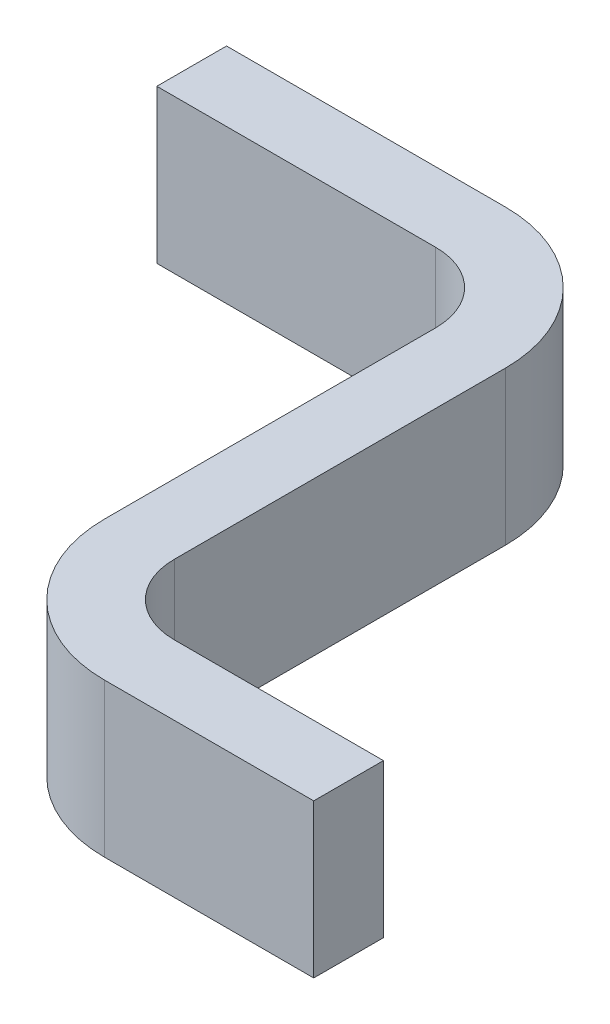
ISO-10303-21;
HEADER;
FILE_DESCRIPTION(('STEP AP214'),'2;1');
FILE_NAME('part.step','',(''),(''),'','','');
FILE_SCHEMA(('AUTOMOTIVE_DESIGN { 1 0 10303 214 1 1 1 1 }'));
ENDSEC;
DATA;
#1=APPLICATION_CONTEXT('core data for automotive mechanical design processes');
#2=APPLICATION_PROTOCOL_DEFINITION('international standard','automotive_design',2000,#1);
#3=PRODUCT_CONTEXT('',#1,'mechanical');
#4=PRODUCT('Part','Part','',(#3));
#5=PRODUCT_RELATED_PRODUCT_CATEGORY('part','',(#4));
#6=PRODUCT_DEFINITION_FORMATION('','',#4);
#7=PRODUCT_DEFINITION_CONTEXT('part definition',#1,'design');
#8=PRODUCT_DEFINITION('design','',#6,#7);
#9=PRODUCT_DEFINITION_SHAPE('','',#8);
#10=(LENGTH_UNIT() NAMED_UNIT(*) SI_UNIT(.MILLI.,.METRE.));
#11=(NAMED_UNIT(*) PLANE_ANGLE_UNIT() SI_UNIT($,.RADIAN.));
#12=(NAMED_UNIT(*) SI_UNIT($,.STERADIAN.) SOLID_ANGLE_UNIT());
#13=UNCERTAINTY_MEASURE_WITH_UNIT(LENGTH_MEASURE(1.E-05),#10,'distance_accuracy_value','');
#14=(GEOMETRIC_REPRESENTATION_CONTEXT(3) GLOBAL_UNCERTAINTY_ASSIGNED_CONTEXT((#13)) GLOBAL_UNIT_ASSIGNED_CONTEXT((#10,
#11,#12)) REPRESENTATION_CONTEXT('',''));
#15=CARTESIAN_POINT('',(0.,0.,0.));
#16=DIRECTION('',(0.,0.,1.));
#17=DIRECTION('',(1.,0.,0.));
#18=AXIS2_PLACEMENT_3D('',#15,#16,#17);
#19=CARTESIAN_POINT('',(-4.,-0.64,0.675));
#20=DIRECTION('',(0.,-1.,0.));
#21=DIRECTION('',(1.,0.,0.));
#22=AXIS2_PLACEMENT_3D('',#19,#20,#21);
#23=PLANE('',#22);
#24=CARTESIAN_POINT('',(-3.8,-0.640000000000001,0.675));
#25=DIRECTION('',(0.,1.,0.));
#26=DIRECTION('',(-1.,0.,0.));
#27=AXIS2_PLACEMENT_3D('',#24,#25,#26);
#28=CIRCLE('',#27,0.2);
#29=CARTESIAN_POINT('',(-3.8,-0.640000000000001,0.875));
#30=VERTEX_POINT('',#29);
#31=CARTESIAN_POINT('',(-4.,-0.64,0.675));
#32=VERTEX_POINT('',#31);
#33=EDGE_CURVE('E150',#30,#32,#28,.F.);
#34=ORIENTED_EDGE('',*,*,#33,.F.);
#35=DIRECTION('',(-1.,0.,0.));
#36=VECTOR('',#35,1.);
#37=CARTESIAN_POINT('',(-3.50000000000001,-0.64,0.875));
#38=LINE('',#37,#36);
#39=CARTESIAN_POINT('',(-3.50000000000001,-0.64,0.875));
#40=VERTEX_POINT('',#39);
#41=EDGE_CURVE('E147',#30,#40,#38,.F.);
#42=ORIENTED_EDGE('',*,*,#41,.T.);
#43=DIRECTION('',(0.,0.,1.));
#44=VECTOR('',#43,1.);
#45=CARTESIAN_POINT('',(-3.50000000000001,-0.64,0.775));
#46=LINE('',#45,#44);
#47=CARTESIAN_POINT('',(-3.50000000000001,-0.64,0.775));
#48=VERTEX_POINT('',#47);
#49=EDGE_CURVE('E141',#48,#40,#46,.T.);
#50=ORIENTED_EDGE('',*,*,#49,.F.);
#51=DIRECTION('',(1.,0.,0.));
#52=VECTOR('',#51,1.);
#53=CARTESIAN_POINT('',(-3.50000000000001,-0.64,0.775));
#54=LINE('',#53,#52);
#55=CARTESIAN_POINT('',(-3.8,-0.640000000000001,0.775));
#56=VERTEX_POINT('',#55);
#57=EDGE_CURVE('E115',#48,#56,#54,.F.);
#58=ORIENTED_EDGE('',*,*,#57,.T.);
#59=CARTESIAN_POINT('',(-3.8,-0.640000000000001,0.675));
#60=DIRECTION('',(0.,1.,0.));
#61=DIRECTION('',(-1.,0.,0.));
#62=AXIS2_PLACEMENT_3D('',#59,#60,#61);
#63=CIRCLE('',#62,0.1);
#64=CARTESIAN_POINT('',(-3.90000000000001,-0.640000000000001,0.675));
#65=VERTEX_POINT('',#64);
#66=EDGE_CURVE('E215',#56,#65,#63,.F.);
#67=ORIENTED_EDGE('',*,*,#66,.T.);
#68=DIRECTION('',(0.,0.,1.));
#69=VECTOR('',#68,1.);
#70=CARTESIAN_POINT('',(-3.90000000000001,-0.640000000000001,0.675));
#71=LINE('',#70,#69);
#72=CARTESIAN_POINT('',(-3.90000000000001,-0.640000000000001,0.2));
#73=VERTEX_POINT('',#72);
#74=EDGE_CURVE('E181',#65,#73,#71,.F.);
#75=ORIENTED_EDGE('',*,*,#74,.T.);
#76=CARTESIAN_POINT('',(-4.1,-0.64,0.2));
#77=DIRECTION('',(0.,-1.,0.));
#78=DIRECTION('',(1.,0.,0.));
#79=AXIS2_PLACEMENT_3D('',#76,#77,#78);
#80=CIRCLE('',#79,0.2);
#81=CARTESIAN_POINT('',(-4.1,-0.64,0.));
#82=VERTEX_POINT('',#81);
#83=EDGE_CURVE('E20',#82,#73,#80,.T.);
#84=ORIENTED_EDGE('',*,*,#83,.F.);
#85=DIRECTION('',(1.,0.,0.));
#86=VECTOR('',#85,1.);
#87=CARTESIAN_POINT('',(-4.1,-0.64,0.));
#88=LINE('',#87,#86);
#89=CARTESIAN_POINT('',(-4.5,-0.64,0.));
#90=VERTEX_POINT('',#89);
#91=EDGE_CURVE('E91',#82,#90,#88,.F.);
#92=ORIENTED_EDGE('',*,*,#91,.T.);
#93=DIRECTION('',(0.,0.,1.));
#94=VECTOR('',#93,1.);
#95=CARTESIAN_POINT('',(-4.5,-0.64,0.));
#96=LINE('',#95,#94);
#97=CARTESIAN_POINT('',(-4.5,-0.64,0.1));
#98=VERTEX_POINT('',#97);
#99=EDGE_CURVE('E163',#90,#98,#96,.T.);
#100=ORIENTED_EDGE('',*,*,#99,.T.);
#101=DIRECTION('',(-1.,0.,0.));
#102=VECTOR('',#101,1.);
#103=CARTESIAN_POINT('',(-4.1,-0.64,0.1));
#104=LINE('',#103,#102);
#105=CARTESIAN_POINT('',(-4.1,-0.64,0.1));
#106=VERTEX_POINT('',#105);
#107=EDGE_CURVE('E159',#98,#106,#104,.F.);
#108=ORIENTED_EDGE('',*,*,#107,.T.);
#109=CARTESIAN_POINT('',(-4.1,-0.64,0.2));
#110=DIRECTION('',(0.,-1.,0.));
#111=DIRECTION('',(1.,0.,0.));
#112=AXIS2_PLACEMENT_3D('',#109,#110,#111);
#113=CIRCLE('',#112,0.1);
#114=CARTESIAN_POINT('',(-4.,-0.64,0.2));
#115=VERTEX_POINT('',#114);
#116=EDGE_CURVE('E155',#106,#115,#113,.T.);
#117=ORIENTED_EDGE('',*,*,#116,.T.);
#118=DIRECTION('',(0.,0.,1.));
#119=VECTOR('',#118,1.);
#120=CARTESIAN_POINT('',(-4.,-0.64,0.675));
#121=LINE('',#120,#119);
#122=EDGE_CURVE('E154',#115,#32,#121,.T.);
#123=ORIENTED_EDGE('',*,*,#122,.T.);
#124=EDGE_LOOP('',(#34,#42,#50,#58,#67,#75,#84,#92,#100,#108,#117,#123));
#125=FACE_BOUND('',#124,.T.);
#126=ADVANCED_FACE('F17',(#125),#23,.F.);
#127=CARTESIAN_POINT('',(-4.1,-0.64,0.2));
#128=DIRECTION('',(0.,-1.,0.));
#129=DIRECTION('',(1.,0.,0.));
#130=AXIS2_PLACEMENT_3D('',#127,#128,#129);
#131=CYLINDRICAL_SURFACE('',#130,0.2);
#132=CARTESIAN_POINT('',(-4.1,-0.86,0.2));
#133=DIRECTION('',(0.,-1.,0.));
#134=DIRECTION('',(1.,0.,0.));
#135=AXIS2_PLACEMENT_3D('',#132,#133,#134);
#136=CIRCLE('',#135,0.2);
#137=CARTESIAN_POINT('',(-3.90000000000001,-0.860000000000001,0.2));
#138=VERTEX_POINT('',#137);
#139=CARTESIAN_POINT('',(-4.1,-0.86,0.));
#140=VERTEX_POINT('',#139);
#141=EDGE_CURVE('E183',#138,#140,#136,.F.);
#142=ORIENTED_EDGE('',*,*,#141,.T.);
#143=DIRECTION('',(0.,1.,0.));
#144=VECTOR('',#143,1.);
#145=CARTESIAN_POINT('',(-4.1,-0.64,0.));
#146=LINE('',#145,#144);
#147=EDGE_CURVE('E178',#140,#82,#146,.T.);
#148=ORIENTED_EDGE('',*,*,#147,.T.);
#149=ORIENTED_EDGE('',*,*,#83,.T.);
#150=DIRECTION('',(0.,-1.,0.));
#151=VECTOR('',#150,1.);
#152=CARTESIAN_POINT('',(-3.90000000000001,-0.640000000000001,0.2));
#153=LINE('',#152,#151);
#154=EDGE_CURVE('E217',#73,#138,#153,.T.);
#155=ORIENTED_EDGE('',*,*,#154,.T.);
#156=EDGE_LOOP('',(#142,#148,#149,#155));
#157=FACE_BOUND('',#156,.T.);
#158=ADVANCED_FACE('F254',(#157),#131,.T.);
#159=CARTESIAN_POINT('',(-4.1,-0.64,0.));
#160=DIRECTION('',(0.,0.,1.));
#161=DIRECTION('',(1.,0.,0.));
#162=AXIS2_PLACEMENT_3D('',#159,#160,#161);
#163=PLANE('',#162);
#164=ORIENTED_EDGE('',*,*,#147,.F.);
#165=DIRECTION('',(-1.,0.,0.));
#166=VECTOR('',#165,1.);
#167=CARTESIAN_POINT('',(-3.90000000000001,-0.860000000000001,0.));
#168=LINE('',#167,#166);
#169=CARTESIAN_POINT('',(-4.5,-0.86,0.));
#170=VERTEX_POINT('',#169);
#171=EDGE_CURVE('E170',#140,#170,#168,.T.);
#172=ORIENTED_EDGE('',*,*,#171,.T.);
#173=DIRECTION('',(0.,1.,0.));
#174=VECTOR('',#173,1.);
#175=CARTESIAN_POINT('',(-4.5,-0.64,0.));
#176=LINE('',#175,#174);
#177=EDGE_CURVE('E173',#170,#90,#176,.T.);
#178=ORIENTED_EDGE('',*,*,#177,.T.);
#179=ORIENTED_EDGE('',*,*,#91,.F.);
#180=EDGE_LOOP('',(#164,#172,#178,#179));
#181=FACE_BOUND('',#180,.T.);
#182=ADVANCED_FACE('F257',(#181),#163,.F.);
#183=CARTESIAN_POINT('',(-4.5,-0.64,0.));
#184=DIRECTION('',(1.,0.,0.));
#185=DIRECTION('',(0.,1.,0.));
#186=AXIS2_PLACEMENT_3D('',#183,#184,#185);
#187=PLANE('',#186);
#188=DIRECTION('',(0.,1.,0.));
#189=VECTOR('',#188,1.);
#190=CARTESIAN_POINT('',(-4.5,-0.86,0.1));
#191=LINE('',#190,#189);
#192=CARTESIAN_POINT('',(-4.5,-0.86,0.1));
#193=VERTEX_POINT('',#192);
#194=EDGE_CURVE('E160',#193,#98,#191,.T.);
#195=ORIENTED_EDGE('',*,*,#194,.T.);
#196=ORIENTED_EDGE('',*,*,#99,.F.);
#197=ORIENTED_EDGE('',*,*,#177,.F.);
#198=DIRECTION('',(0.,0.,1.));
#199=VECTOR('',#198,1.);
#200=CARTESIAN_POINT('',(-4.5,-0.86,0.675));
#201=LINE('',#200,#199);
#202=EDGE_CURVE('E166',#170,#193,#201,.T.);
#203=ORIENTED_EDGE('',*,*,#202,.T.);
#204=EDGE_LOOP('',(#195,#196,#197,#203));
#205=FACE_BOUND('',#204,.T.);
#206=ADVANCED_FACE('F259',(#205),#187,.F.);
#207=CARTESIAN_POINT('',(-4.1,-0.86,0.1));
#208=DIRECTION('',(0.,0.,-1.));
#209=DIRECTION('',(-1.,0.,0.));
#210=AXIS2_PLACEMENT_3D('',#207,#208,#209);
#211=PLANE('',#210);
#212=DIRECTION('',(0.,-1.,0.));
#213=VECTOR('',#212,1.);
#214=CARTESIAN_POINT('',(-4.1,-0.86,0.1));
#215=LINE('',#214,#213);
#216=CARTESIAN_POINT('',(-4.1,-0.86,0.1));
#217=VERTEX_POINT('',#216);
#218=EDGE_CURVE('E156',#217,#106,#215,.F.);
#219=ORIENTED_EDGE('',*,*,#218,.T.);
#220=ORIENTED_EDGE('',*,*,#107,.F.);
#221=ORIENTED_EDGE('',*,*,#194,.F.);
#222=DIRECTION('',(-1.,0.,0.));
#223=VECTOR('',#222,1.);
#224=CARTESIAN_POINT('',(-3.90000000000001,-0.860000000000001,0.1));
#225=LINE('',#224,#223);
#226=EDGE_CURVE('E169',#193,#217,#225,.F.);
#227=ORIENTED_EDGE('',*,*,#226,.T.);
#228=EDGE_LOOP('',(#219,#220,#221,#227));
#229=FACE_BOUND('',#228,.T.);
#230=ADVANCED_FACE('F234',(#229),#211,.F.);
#231=CARTESIAN_POINT('',(-4.1,-0.86,0.2));
#232=DIRECTION('',(0.,-1.,0.));
#233=DIRECTION('',(1.,0.,0.));
#234=AXIS2_PLACEMENT_3D('',#231,#232,#233);
#235=CYLINDRICAL_SURFACE('',#234,0.1);
#236=DIRECTION('',(0.,1.,0.));
#237=VECTOR('',#236,1.);
#238=CARTESIAN_POINT('',(-4.,-0.86,0.2));
#239=LINE('',#238,#237);
#240=CARTESIAN_POINT('',(-4.,-0.86,0.2));
#241=VERTEX_POINT('',#240);
#242=EDGE_CURVE('E151',#241,#115,#239,.T.);
#243=ORIENTED_EDGE('',*,*,#242,.T.);
#244=ORIENTED_EDGE('',*,*,#116,.F.);
#245=ORIENTED_EDGE('',*,*,#218,.F.);
#246=CARTESIAN_POINT('',(-4.1,-0.86,0.2));
#247=DIRECTION('',(0.,-1.,0.));
#248=DIRECTION('',(1.,0.,0.));
#249=AXIS2_PLACEMENT_3D('',#246,#247,#248);
#250=CIRCLE('',#249,0.1);
#251=EDGE_CURVE('E210',#217,#241,#250,.T.);
#252=ORIENTED_EDGE('',*,*,#251,.T.);
#253=EDGE_LOOP('',(#243,#244,#245,#252));
#254=FACE_BOUND('',#253,.T.);
#255=ADVANCED_FACE('F227',(#254),#235,.F.);
#256=CARTESIAN_POINT('',(-4.,-0.86,0.675));
#257=DIRECTION('',(1.,0.,0.));
#258=DIRECTION('',(0.,1.,0.));
#259=AXIS2_PLACEMENT_3D('',#256,#257,#258);
#260=PLANE('',#259);
#261=DIRECTION('',(0.,1.,0.));
#262=VECTOR('',#261,1.);
#263=CARTESIAN_POINT('',(-4.,-0.86,0.675));
#264=LINE('',#263,#262);
#265=CARTESIAN_POINT('',(-4.,-0.86,0.675));
#266=VERTEX_POINT('',#265);
#267=EDGE_CURVE('E148',#32,#266,#264,.F.);
#268=ORIENTED_EDGE('',*,*,#267,.F.);
#269=ORIENTED_EDGE('',*,*,#122,.F.);
#270=ORIENTED_EDGE('',*,*,#242,.F.);
#271=DIRECTION('',(0.,0.,1.));
#272=VECTOR('',#271,1.);
#273=CARTESIAN_POINT('',(-4.,-0.86,0.675));
#274=LINE('',#273,#272);
#275=EDGE_CURVE('E209',#241,#266,#274,.T.);
#276=ORIENTED_EDGE('',*,*,#275,.T.);
#277=EDGE_LOOP('',(#268,#269,#270,#276));
#278=FACE_BOUND('',#277,.T.);
#279=ADVANCED_FACE('F224',(#278),#260,.F.);
#280=CARTESIAN_POINT('',(-3.8,-0.860000000000001,0.675));
#281=DIRECTION('',(0.,1.,0.));
#282=DIRECTION('',(-1.,0.,0.));
#283=AXIS2_PLACEMENT_3D('',#280,#281,#282);
#284=CYLINDRICAL_SURFACE('',#283,0.2);
#285=ORIENTED_EDGE('',*,*,#33,.T.);
#286=ORIENTED_EDGE('',*,*,#267,.T.);
#287=CARTESIAN_POINT('',(-3.8,-0.860000000000001,0.675));
#288=DIRECTION('',(0.,1.,0.));
#289=DIRECTION('',(-1.,0.,0.));
#290=AXIS2_PLACEMENT_3D('',#287,#288,#289);
#291=CIRCLE('',#290,0.2);
#292=CARTESIAN_POINT('',(-3.8,-0.860000000000001,0.875));
#293=VERTEX_POINT('',#292);
#294=EDGE_CURVE('E133',#266,#293,#291,.T.);
#295=ORIENTED_EDGE('',*,*,#294,.T.);
#296=DIRECTION('',(0.,1.,0.));
#297=VECTOR('',#296,1.);
#298=CARTESIAN_POINT('',(-3.8,-0.860000000000001,0.875));
#299=LINE('',#298,#297);
#300=EDGE_CURVE('E144',#293,#30,#299,.T.);
#301=ORIENTED_EDGE('',*,*,#300,.T.);
#302=EDGE_LOOP('',(#285,#286,#295,#301));
#303=FACE_BOUND('',#302,.T.);
#304=ADVANCED_FACE('F285',(#303),#284,.T.);
#305=CARTESIAN_POINT('',(-3.50000000000001,-0.86,0.875));
#306=DIRECTION('',(0.,0.,-1.));
#307=DIRECTION('',(-1.,0.,0.));
#308=AXIS2_PLACEMENT_3D('',#305,#306,#307);
#309=PLANE('',#308);
#310=DIRECTION('',(0.,1.,0.));
#311=VECTOR('',#310,1.);
#312=CARTESIAN_POINT('',(-3.50000000000001,-0.64,0.875));
#313=LINE('',#312,#311);
#314=CARTESIAN_POINT('',(-3.50000000000001,-0.86,0.875));
#315=VERTEX_POINT('',#314);
#316=EDGE_CURVE('E118',#40,#315,#313,.F.);
#317=ORIENTED_EDGE('',*,*,#316,.F.);
#318=ORIENTED_EDGE('',*,*,#41,.F.);
#319=ORIENTED_EDGE('',*,*,#300,.F.);
#320=DIRECTION('',(-1.,0.,0.));
#321=VECTOR('',#320,1.);
#322=CARTESIAN_POINT('',(-3.90000000000001,-0.860000000000001,0.875));
#323=LINE('',#322,#321);
#324=EDGE_CURVE('E131',#293,#315,#323,.F.);
#325=ORIENTED_EDGE('',*,*,#324,.T.);
#326=EDGE_LOOP('',(#317,#318,#319,#325));
#327=FACE_BOUND('',#326,.T.);
#328=ADVANCED_FACE('F282',(#327),#309,.F.);
#329=CARTESIAN_POINT('',(-3.50000000000001,-0.64,0.775));
#330=DIRECTION('',(1.,0.,0.));
#331=DIRECTION('',(0.,1.,0.));
#332=AXIS2_PLACEMENT_3D('',#329,#330,#331);
#333=PLANE('',#332);
#334=ORIENTED_EDGE('',*,*,#49,.T.);
#335=ORIENTED_EDGE('',*,*,#316,.T.);
#336=DIRECTION('',(0.,0.,1.));
#337=VECTOR('',#336,1.);
#338=CARTESIAN_POINT('',(-3.50000000000001,-0.86,0.675));
#339=LINE('',#338,#337);
#340=CARTESIAN_POINT('',(-3.50000000000001,-0.86,0.775));
#341=VERTEX_POINT('',#340);
#342=EDGE_CURVE('E125',#315,#341,#339,.F.);
#343=ORIENTED_EDGE('',*,*,#342,.T.);
#344=DIRECTION('',(0.,1.,0.));
#345=VECTOR('',#344,1.);
#346=CARTESIAN_POINT('',(-3.50000000000001,-0.64,0.775));
#347=LINE('',#346,#345);
#348=EDGE_CURVE('E110',#341,#48,#347,.T.);
#349=ORIENTED_EDGE('',*,*,#348,.T.);
#350=EDGE_LOOP('',(#334,#335,#343,#349));
#351=FACE_BOUND('',#350,.T.);
#352=ADVANCED_FACE('F129',(#351),#333,.T.);
#353=CARTESIAN_POINT('',(-3.50000000000001,-0.64,0.775));
#354=DIRECTION('',(0.,0.,1.));
#355=DIRECTION('',(1.,0.,0.));
#356=AXIS2_PLACEMENT_3D('',#353,#354,#355);
#357=PLANE('',#356);
#358=ORIENTED_EDGE('',*,*,#348,.F.);
#359=DIRECTION('',(-1.,0.,0.));
#360=VECTOR('',#359,1.);
#361=CARTESIAN_POINT('',(-3.90000000000001,-0.860000000000001,0.775));
#362=LINE('',#361,#360);
#363=CARTESIAN_POINT('',(-3.8,-0.860000000000001,0.775));
#364=VERTEX_POINT('',#363);
#365=EDGE_CURVE('E114',#341,#364,#362,.T.);
#366=ORIENTED_EDGE('',*,*,#365,.T.);
#367=DIRECTION('',(0.,1.,0.));
#368=VECTOR('',#367,1.);
#369=CARTESIAN_POINT('',(-3.8,-0.640000000000001,0.775));
#370=LINE('',#369,#368);
#371=EDGE_CURVE('E185',#364,#56,#370,.T.);
#372=ORIENTED_EDGE('',*,*,#371,.T.);
#373=ORIENTED_EDGE('',*,*,#57,.F.);
#374=EDGE_LOOP('',(#358,#366,#372,#373));
#375=FACE_BOUND('',#374,.T.);
#376=ADVANCED_FACE('F112',(#375),#357,.F.);
#377=CARTESIAN_POINT('',(-3.8,-0.640000000000001,0.675));
#378=DIRECTION('',(0.,1.,0.));
#379=DIRECTION('',(-1.,0.,0.));
#380=AXIS2_PLACEMENT_3D('',#377,#378,#379);
#381=CYLINDRICAL_SURFACE('',#380,0.1);
#382=ORIENTED_EDGE('',*,*,#371,.F.);
#383=CARTESIAN_POINT('',(-3.8,-0.860000000000001,0.675));
#384=DIRECTION('',(0.,1.,0.));
#385=DIRECTION('',(-1.,0.,0.));
#386=AXIS2_PLACEMENT_3D('',#383,#384,#385);
#387=CIRCLE('',#386,0.1);
#388=CARTESIAN_POINT('',(-3.90000000000001,-0.860000000000001,0.675));
#389=VERTEX_POINT('',#388);
#390=EDGE_CURVE('E26',#364,#389,#387,.F.);
#391=ORIENTED_EDGE('',*,*,#390,.T.);
#392=DIRECTION('',(0.,-1.,0.));
#393=VECTOR('',#392,1.);
#394=CARTESIAN_POINT('',(-3.90000000000001,-0.640000000000001,0.675));
#395=LINE('',#394,#393);
#396=EDGE_CURVE('E34',#389,#65,#395,.F.);
#397=ORIENTED_EDGE('',*,*,#396,.T.);
#398=ORIENTED_EDGE('',*,*,#66,.F.);
#399=EDGE_LOOP('',(#382,#391,#397,#398));
#400=FACE_BOUND('',#399,.T.);
#401=ADVANCED_FACE('F250',(#400),#381,.F.);
#402=CARTESIAN_POINT('',(-3.90000000000001,-0.640000000000001,0.675));
#403=DIRECTION('',(-1.,0.,0.));
#404=DIRECTION('',(0.,-1.,0.));
#405=AXIS2_PLACEMENT_3D('',#402,#403,#404);
#406=PLANE('',#405);
#407=ORIENTED_EDGE('',*,*,#396,.F.);
#408=DIRECTION('',(0.,0.,1.));
#409=VECTOR('',#408,1.);
#410=CARTESIAN_POINT('',(-3.90000000000001,-0.860000000000001,0.675));
#411=LINE('',#410,#409);
#412=EDGE_CURVE('E11',#389,#138,#411,.F.);
#413=ORIENTED_EDGE('',*,*,#412,.T.);
#414=ORIENTED_EDGE('',*,*,#154,.F.);
#415=ORIENTED_EDGE('',*,*,#74,.F.);
#416=EDGE_LOOP('',(#407,#413,#414,#415));
#417=FACE_BOUND('',#416,.T.);
#418=ADVANCED_FACE('F252',(#417),#406,.F.);
#419=CARTESIAN_POINT('',(-3.90000000000001,-0.860000000000001,0.675));
#420=DIRECTION('',(0.,1.,0.));
#421=DIRECTION('',(-1.,0.,0.));
#422=AXIS2_PLACEMENT_3D('',#419,#420,#421);
#423=PLANE('',#422);
#424=ORIENTED_EDGE('',*,*,#390,.F.);
#425=ORIENTED_EDGE('',*,*,#365,.F.);
#426=ORIENTED_EDGE('',*,*,#342,.F.);
#427=ORIENTED_EDGE('',*,*,#324,.F.);
#428=ORIENTED_EDGE('',*,*,#294,.F.);
#429=ORIENTED_EDGE('',*,*,#275,.F.);
#430=ORIENTED_EDGE('',*,*,#251,.F.);
#431=ORIENTED_EDGE('',*,*,#226,.F.);
#432=ORIENTED_EDGE('',*,*,#202,.F.);
#433=ORIENTED_EDGE('',*,*,#171,.F.);
#434=ORIENTED_EDGE('',*,*,#141,.F.);
#435=ORIENTED_EDGE('',*,*,#412,.F.);
#436=EDGE_LOOP('',(#424,#425,#426,#427,#428,#429,#430,#431,#432,#433,#434,#435));
#437=FACE_BOUND('',#436,.T.);
#438=ADVANCED_FACE('F123',(#437),#423,.F.);
#439=CLOSED_SHELL('',(#126,#158,#182,#206,#230,#255,#279,#304,#328,#352,#376,#401,#418,#438));
#440=MANIFOLD_SOLID_BREP('B1',#439);
#441=ADVANCED_BREP_SHAPE_REPRESENTATION('',(#18,#440),#14);
#442=SHAPE_DEFINITION_REPRESENTATION(#9,#441);
ENDSEC;
END-ISO-10303-21;
